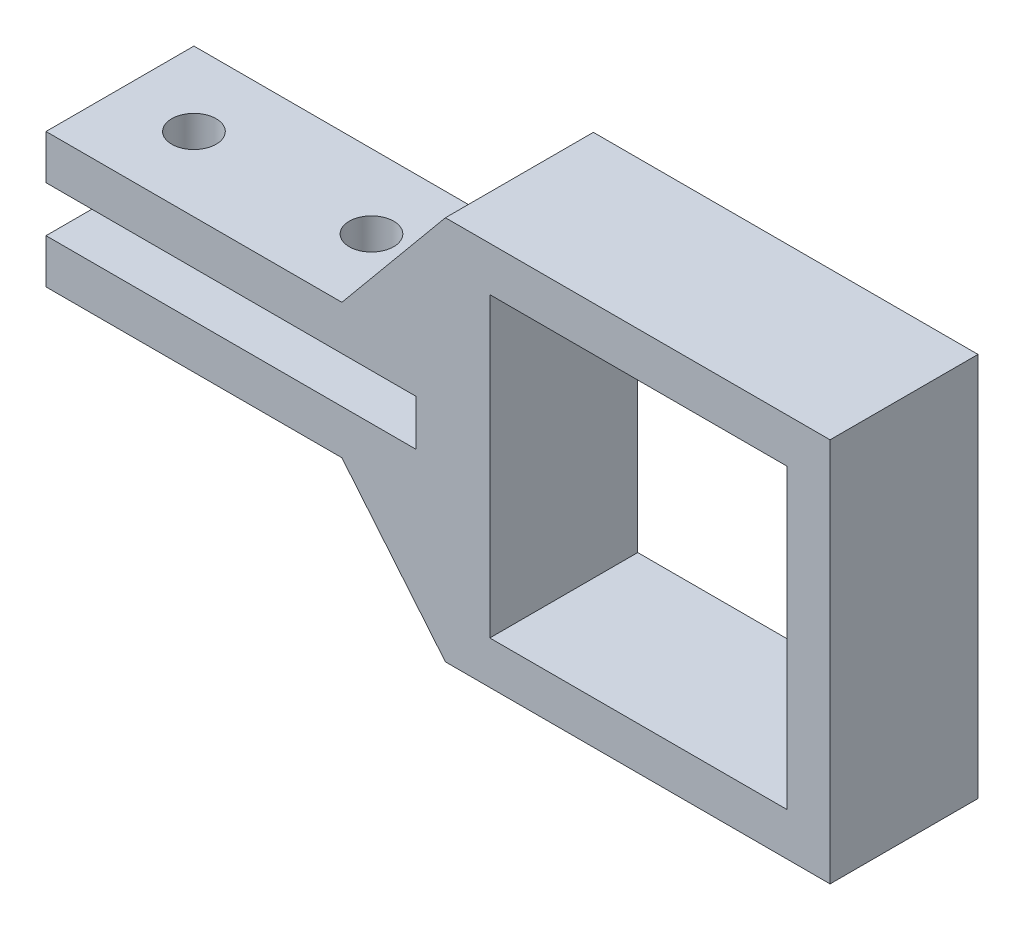
ISO-10303-21;
HEADER;
FILE_DESCRIPTION(('STEP AP214'),'2;1');
FILE_NAME('part.step','',(''),(''),'','','');
FILE_SCHEMA(('AUTOMOTIVE_DESIGN { 1 0 10303 214 1 1 1 1 }'));
ENDSEC;
DATA;
#1=APPLICATION_CONTEXT('core data for automotive mechanical design processes');
#2=APPLICATION_PROTOCOL_DEFINITION('international standard','automotive_design',2000,#1);
#3=PRODUCT_CONTEXT('',#1,'mechanical');
#4=PRODUCT('Part','Part','',(#3));
#5=PRODUCT_RELATED_PRODUCT_CATEGORY('part','',(#4));
#6=PRODUCT_DEFINITION_FORMATION('','',#4);
#7=PRODUCT_DEFINITION_CONTEXT('part definition',#1,'design');
#8=PRODUCT_DEFINITION('design','',#6,#7);
#9=PRODUCT_DEFINITION_SHAPE('','',#8);
#10=(LENGTH_UNIT() NAMED_UNIT(*) SI_UNIT(.MILLI.,.METRE.));
#11=(NAMED_UNIT(*) PLANE_ANGLE_UNIT() SI_UNIT($,.RADIAN.));
#12=(NAMED_UNIT(*) SI_UNIT($,.STERADIAN.) SOLID_ANGLE_UNIT());
#13=UNCERTAINTY_MEASURE_WITH_UNIT(LENGTH_MEASURE(1.E-05),#10,'distance_accuracy_value','');
#14=(GEOMETRIC_REPRESENTATION_CONTEXT(3) GLOBAL_UNCERTAINTY_ASSIGNED_CONTEXT((#13)) GLOBAL_UNIT_ASSIGNED_CONTEXT((#10,
#11,#12)) REPRESENTATION_CONTEXT('',''));
#15=CARTESIAN_POINT('',(0.,0.,0.));
#16=DIRECTION('',(0.,0.,1.));
#17=DIRECTION('',(1.,0.,0.));
#18=AXIS2_PLACEMENT_3D('',#15,#16,#17);
#19=CARTESIAN_POINT('',(0.,-13.,10.));
#20=DIRECTION('',(-0.770085518726512,-0.637940666400661,0.));
#21=DIRECTION('',(0.637940666400661,-0.770085518726512,0.));
#22=AXIS2_PLACEMENT_3D('',#19,#20,#21);
#23=PLANE('',#22);
#24=DIRECTION('',(-0.637940666400661,0.770085518726512,0.));
#25=VECTOR('',#24,1.);
#26=CARTESIAN_POINT('',(0.,-13.,0.));
#27=LINE('',#26,#25);
#28=CARTESIAN_POINT('',(0.,-13.,0.));
#29=VERTEX_POINT('',#28);
#30=CARTESIAN_POINT('',(-7.,-4.55,0.));
#31=VERTEX_POINT('',#30);
#32=EDGE_CURVE('E171',#29,#31,#27,.T.);
#33=ORIENTED_EDGE('',*,*,#32,.F.);
#34=DIRECTION('',(0.,0.,-1.));
#35=VECTOR('',#34,1.);
#36=CARTESIAN_POINT('',(0.,-13.,10.));
#37=LINE('',#36,#35);
#38=CARTESIAN_POINT('',(0.,-13.,10.));
#39=VERTEX_POINT('',#38);
#40=EDGE_CURVE('E238',#39,#29,#37,.T.);
#41=ORIENTED_EDGE('',*,*,#40,.F.);
#42=DIRECTION('',(-0.637940666400661,0.770085518726512,0.));
#43=VECTOR('',#42,1.);
#44=CARTESIAN_POINT('',(0.,-13.,10.));
#45=LINE('',#44,#43);
#46=CARTESIAN_POINT('',(-7.,-4.55,10.));
#47=VERTEX_POINT('',#46);
#48=EDGE_CURVE('E174',#39,#47,#45,.T.);
#49=ORIENTED_EDGE('',*,*,#48,.T.);
#50=DIRECTION('',(0.,0.,-1.));
#51=VECTOR('',#50,1.);
#52=CARTESIAN_POINT('',(-7.,-4.55,10.));
#53=LINE('',#52,#51);
#54=EDGE_CURVE('E205',#47,#31,#53,.T.);
#55=ORIENTED_EDGE('',*,*,#54,.T.);
#56=EDGE_LOOP('',(#33,#41,#49,#55));
#57=FACE_BOUND('',#56,.T.);
#58=ADVANCED_FACE('F33',(#57),#23,.T.);
#59=CARTESIAN_POINT('',(0.,-13.,10.));
#60=DIRECTION('',(0.,1.,0.));
#61=DIRECTION('',(-1.,0.,0.));
#62=AXIS2_PLACEMENT_3D('',#59,#60,#61);
#63=PLANE('',#62);
#64=DIRECTION('',(1.,0.,0.));
#65=VECTOR('',#64,1.);
#66=CARTESIAN_POINT('',(0.,-13.,0.));
#67=LINE('',#66,#65);
#68=CARTESIAN_POINT('',(26.,-13.,0.));
#69=VERTEX_POINT('',#68);
#70=EDGE_CURVE('E178',#29,#69,#67,.T.);
#71=ORIENTED_EDGE('',*,*,#70,.T.);
#72=DIRECTION('',(0.,0.,-1.));
#73=VECTOR('',#72,1.);
#74=CARTESIAN_POINT('',(26.,-13.,10.));
#75=LINE('',#74,#73);
#76=CARTESIAN_POINT('',(26.,-13.,10.));
#77=VERTEX_POINT('',#76);
#78=EDGE_CURVE('E241',#77,#69,#75,.T.);
#79=ORIENTED_EDGE('',*,*,#78,.F.);
#80=DIRECTION('',(1.,0.,0.));
#81=VECTOR('',#80,1.);
#82=CARTESIAN_POINT('',(0.,-13.,10.));
#83=LINE('',#82,#81);
#84=EDGE_CURVE('E203',#39,#77,#83,.T.);
#85=ORIENTED_EDGE('',*,*,#84,.F.);
#86=ORIENTED_EDGE('',*,*,#40,.T.);
#87=EDGE_LOOP('',(#71,#79,#85,#86));
#88=FACE_BOUND('',#87,.T.);
#89=ADVANCED_FACE('F284',(#88),#63,.F.);
#90=CARTESIAN_POINT('',(26.,13.,10.));
#91=DIRECTION('',(1.,0.,0.));
#92=DIRECTION('',(0.,0.,-1.));
#93=AXIS2_PLACEMENT_3D('',#90,#91,#92);
#94=PLANE('',#93);
#95=DIRECTION('',(0.,-1.,0.));
#96=VECTOR('',#95,1.);
#97=CARTESIAN_POINT('',(26.,13.,0.));
#98=LINE('',#97,#96);
#99=CARTESIAN_POINT('',(26.,13.,0.));
#100=VERTEX_POINT('',#99);
#101=EDGE_CURVE('E233',#100,#69,#98,.T.);
#102=ORIENTED_EDGE('',*,*,#101,.F.);
#103=DIRECTION('',(0.,0.,-1.));
#104=VECTOR('',#103,1.);
#105=CARTESIAN_POINT('',(26.,13.,10.));
#106=LINE('',#105,#104);
#107=CARTESIAN_POINT('',(26.,13.,10.));
#108=VERTEX_POINT('',#107);
#109=EDGE_CURVE('E243',#108,#100,#106,.T.);
#110=ORIENTED_EDGE('',*,*,#109,.F.);
#111=DIRECTION('',(0.,-1.,0.));
#112=VECTOR('',#111,1.);
#113=CARTESIAN_POINT('',(26.,13.,10.));
#114=LINE('',#113,#112);
#115=EDGE_CURVE('E200',#108,#77,#114,.T.);
#116=ORIENTED_EDGE('',*,*,#115,.T.);
#117=ORIENTED_EDGE('',*,*,#78,.T.);
#118=EDGE_LOOP('',(#102,#110,#116,#117));
#119=FACE_BOUND('',#118,.T.);
#120=ADVANCED_FACE('F289',(#119),#94,.T.);
#121=CARTESIAN_POINT('',(0.,13.,10.));
#122=DIRECTION('',(0.,1.,0.));
#123=DIRECTION('',(-1.,0.,0.));
#124=AXIS2_PLACEMENT_3D('',#121,#122,#123);
#125=PLANE('',#124);
#126=DIRECTION('',(1.,0.,0.));
#127=VECTOR('',#126,1.);
#128=CARTESIAN_POINT('',(0.,13.,0.));
#129=LINE('',#128,#127);
#130=CARTESIAN_POINT('',(0.,13.,0.));
#131=VERTEX_POINT('',#130);
#132=EDGE_CURVE('E230',#131,#100,#129,.T.);
#133=ORIENTED_EDGE('',*,*,#132,.F.);
#134=DIRECTION('',(0.,0.,-1.));
#135=VECTOR('',#134,1.);
#136=CARTESIAN_POINT('',(0.,13.,10.));
#137=LINE('',#136,#135);
#138=CARTESIAN_POINT('',(0.,13.,10.));
#139=VERTEX_POINT('',#138);
#140=EDGE_CURVE('E245',#139,#131,#137,.T.);
#141=ORIENTED_EDGE('',*,*,#140,.F.);
#142=DIRECTION('',(1.,0.,0.));
#143=VECTOR('',#142,1.);
#144=CARTESIAN_POINT('',(0.,13.,10.));
#145=LINE('',#144,#143);
#146=EDGE_CURVE('E197',#139,#108,#145,.T.);
#147=ORIENTED_EDGE('',*,*,#146,.T.);
#148=ORIENTED_EDGE('',*,*,#109,.T.);
#149=EDGE_LOOP('',(#133,#141,#147,#148));
#150=FACE_BOUND('',#149,.T.);
#151=ADVANCED_FACE('F337',(#150),#125,.T.);
#152=CARTESIAN_POINT('',(0.,13.,10.));
#153=DIRECTION('',(0.770085518726512,-0.637940666400661,0.));
#154=DIRECTION('',(0.637940666400661,0.770085518726512,0.));
#155=AXIS2_PLACEMENT_3D('',#152,#153,#154);
#156=PLANE('',#155);
#157=DIRECTION('',(-0.637940666400661,-0.770085518726512,0.));
#158=VECTOR('',#157,1.);
#159=CARTESIAN_POINT('',(0.,13.,0.));
#160=LINE('',#159,#158);
#161=CARTESIAN_POINT('',(-7.,4.55,0.));
#162=VERTEX_POINT('',#161);
#163=EDGE_CURVE('E227',#131,#162,#160,.T.);
#164=ORIENTED_EDGE('',*,*,#163,.T.);
#165=DIRECTION('',(0.,0.,-1.));
#166=VECTOR('',#165,1.);
#167=CARTESIAN_POINT('',(-7.,4.55,10.));
#168=LINE('',#167,#166);
#169=CARTESIAN_POINT('',(-7.,4.55,10.));
#170=VERTEX_POINT('',#169);
#171=EDGE_CURVE('E247',#170,#162,#168,.T.);
#172=ORIENTED_EDGE('',*,*,#171,.F.);
#173=DIRECTION('',(-0.637940666400661,-0.770085518726512,0.));
#174=VECTOR('',#173,1.);
#175=CARTESIAN_POINT('',(0.,13.,10.));
#176=LINE('',#175,#174);
#177=EDGE_CURVE('E195',#139,#170,#176,.T.);
#178=ORIENTED_EDGE('',*,*,#177,.F.);
#179=ORIENTED_EDGE('',*,*,#140,.T.);
#180=EDGE_LOOP('',(#164,#172,#178,#179));
#181=FACE_BOUND('',#180,.T.);
#182=ADVANCED_FACE('F334',(#181),#156,.F.);
#183=CARTESIAN_POINT('',(-27.,4.55,10.));
#184=DIRECTION('',(0.,1.,0.));
#185=DIRECTION('',(0.,0.,1.));
#186=AXIS2_PLACEMENT_3D('',#183,#184,#185);
#187=PLANE('',#186);
#188=CARTESIAN_POINT('',(-22.,4.55,5.));
#189=DIRECTION('',(0.,1.,0.));
#190=DIRECTION('',(-1.,0.,0.));
#191=AXIS2_PLACEMENT_3D('',#188,#189,#190);
#192=CIRCLE('',#191,1.5);
#193=CARTESIAN_POINT('',(-23.5,4.55,5.));
#194=VERTEX_POINT('',#193);
#195=EDGE_CURVE('E372',#194,#194,#192,.T.);
#196=ORIENTED_EDGE('',*,*,#195,.F.);
#197=EDGE_LOOP('',(#196));
#198=FACE_BOUND('',#197,.T.);
#199=CARTESIAN_POINT('',(-10.,4.55,5.));
#200=DIRECTION('',(0.,1.,0.));
#201=DIRECTION('',(-1.,0.,0.));
#202=AXIS2_PLACEMENT_3D('',#199,#200,#201);
#203=CIRCLE('',#202,1.5);
#204=CARTESIAN_POINT('',(-11.5,4.55,5.));
#205=VERTEX_POINT('',#204);
#206=EDGE_CURVE('E373',#205,#205,#203,.T.);
#207=ORIENTED_EDGE('',*,*,#206,.F.);
#208=EDGE_LOOP('',(#207));
#209=FACE_BOUND('',#208,.T.);
#210=DIRECTION('',(1.,0.,0.));
#211=VECTOR('',#210,1.);
#212=CARTESIAN_POINT('',(-27.,4.55,0.));
#213=LINE('',#212,#211);
#214=CARTESIAN_POINT('',(-27.,4.55,0.));
#215=VERTEX_POINT('',#214);
#216=EDGE_CURVE('E224',#215,#162,#213,.T.);
#217=ORIENTED_EDGE('',*,*,#216,.F.);
#218=DIRECTION('',(0.,0.,-1.));
#219=VECTOR('',#218,1.);
#220=CARTESIAN_POINT('',(-27.,4.55,10.));
#221=LINE('',#220,#219);
#222=CARTESIAN_POINT('',(-27.,4.55,10.));
#223=VERTEX_POINT('',#222);
#224=EDGE_CURVE('E249',#223,#215,#221,.T.);
#225=ORIENTED_EDGE('',*,*,#224,.F.);
#226=DIRECTION('',(1.,0.,0.));
#227=VECTOR('',#226,1.);
#228=CARTESIAN_POINT('',(-27.,4.55,10.));
#229=LINE('',#228,#227);
#230=EDGE_CURVE('E192',#223,#170,#229,.T.);
#231=ORIENTED_EDGE('',*,*,#230,.T.);
#232=ORIENTED_EDGE('',*,*,#171,.T.);
#233=EDGE_LOOP('',(#217,#225,#231,#232));
#234=FACE_BOUND('',#233,.T.);
#235=ADVANCED_FACE('F328',(#198,#209,#234),#187,.T.);
#236=CARTESIAN_POINT('',(-27.,4.55,10.));
#237=DIRECTION('',(1.,0.,0.));
#238=DIRECTION('',(0.,0.,-1.));
#239=AXIS2_PLACEMENT_3D('',#236,#237,#238);
#240=PLANE('',#239);
#241=DIRECTION('',(0.,-1.,0.));
#242=VECTOR('',#241,1.);
#243=CARTESIAN_POINT('',(-27.,4.55,0.));
#244=LINE('',#243,#242);
#245=CARTESIAN_POINT('',(-27.,1.55,0.));
#246=VERTEX_POINT('',#245);
#247=EDGE_CURVE('E222',#215,#246,#244,.T.);
#248=ORIENTED_EDGE('',*,*,#247,.T.);
#249=DIRECTION('',(0.,0.,-1.));
#250=VECTOR('',#249,1.);
#251=CARTESIAN_POINT('',(-27.,1.55,10.));
#252=LINE('',#251,#250);
#253=CARTESIAN_POINT('',(-27.,1.55,10.));
#254=VERTEX_POINT('',#253);
#255=EDGE_CURVE('E251',#254,#246,#252,.T.);
#256=ORIENTED_EDGE('',*,*,#255,.F.);
#257=DIRECTION('',(0.,-1.,0.));
#258=VECTOR('',#257,1.);
#259=CARTESIAN_POINT('',(-27.,4.55,10.));
#260=LINE('',#259,#258);
#261=EDGE_CURVE('E190',#223,#254,#260,.T.);
#262=ORIENTED_EDGE('',*,*,#261,.F.);
#263=ORIENTED_EDGE('',*,*,#224,.T.);
#264=EDGE_LOOP('',(#248,#256,#262,#263));
#265=FACE_BOUND('',#264,.T.);
#266=ADVANCED_FACE('F340',(#265),#240,.F.);
#267=CARTESIAN_POINT('',(-27.,1.55,10.));
#268=DIRECTION('',(0.,1.,0.));
#269=DIRECTION('',(0.,0.,1.));
#270=AXIS2_PLACEMENT_3D('',#267,#268,#269);
#271=PLANE('',#270);
#272=CARTESIAN_POINT('',(-22.,1.55,5.));
#273=DIRECTION('',(0.,1.,0.));
#274=DIRECTION('',(0.,0.,1.));
#275=AXIS2_PLACEMENT_3D('',#272,#273,#274);
#276=CIRCLE('',#275,1.5);
#277=CARTESIAN_POINT('',(-22.,1.55,6.5));
#278=VERTEX_POINT('',#277);
#279=EDGE_CURVE('E390',#278,#278,#276,.T.);
#280=ORIENTED_EDGE('',*,*,#279,.T.);
#281=EDGE_LOOP('',(#280));
#282=FACE_BOUND('',#281,.T.);
#283=CARTESIAN_POINT('',(-10.,1.55,5.));
#284=DIRECTION('',(0.,1.,0.));
#285=DIRECTION('',(0.,0.,1.));
#286=AXIS2_PLACEMENT_3D('',#283,#284,#285);
#287=CIRCLE('',#286,1.5);
#288=CARTESIAN_POINT('',(-10.,1.55,6.5));
#289=VERTEX_POINT('',#288);
#290=EDGE_CURVE('E384',#289,#289,#287,.T.);
#291=ORIENTED_EDGE('',*,*,#290,.T.);
#292=EDGE_LOOP('',(#291));
#293=FACE_BOUND('',#292,.T.);
#294=DIRECTION('',(1.,0.,0.));
#295=VECTOR('',#294,1.);
#296=CARTESIAN_POINT('',(-27.,1.55,0.));
#297=LINE('',#296,#295);
#298=CARTESIAN_POINT('',(-2.,1.55,0.));
#299=VERTEX_POINT('',#298);
#300=EDGE_CURVE('E220',#246,#299,#297,.T.);
#301=ORIENTED_EDGE('',*,*,#300,.T.);
#302=DIRECTION('',(0.,0.,-1.));
#303=VECTOR('',#302,1.);
#304=CARTESIAN_POINT('',(-2.,1.55,10.));
#305=LINE('',#304,#303);
#306=CARTESIAN_POINT('',(-2.,1.55,10.));
#307=VERTEX_POINT('',#306);
#308=EDGE_CURVE('E254',#307,#299,#305,.T.);
#309=ORIENTED_EDGE('',*,*,#308,.F.);
#310=DIRECTION('',(1.,0.,0.));
#311=VECTOR('',#310,1.);
#312=CARTESIAN_POINT('',(-27.,1.55,10.));
#313=LINE('',#312,#311);
#314=EDGE_CURVE('E188',#254,#307,#313,.T.);
#315=ORIENTED_EDGE('',*,*,#314,.F.);
#316=ORIENTED_EDGE('',*,*,#255,.T.);
#317=EDGE_LOOP('',(#301,#309,#315,#316));
#318=FACE_BOUND('',#317,.T.);
#319=ADVANCED_FACE('F321',(#282,#293,#318),#271,.F.);
#320=CARTESIAN_POINT('',(-2.,1.55,10.));
#321=DIRECTION('',(1.,0.,0.));
#322=DIRECTION('',(0.,0.,-1.));
#323=AXIS2_PLACEMENT_3D('',#320,#321,#322);
#324=PLANE('',#323);
#325=DIRECTION('',(0.,-1.,0.));
#326=VECTOR('',#325,1.);
#327=CARTESIAN_POINT('',(-2.,1.55,0.));
#328=LINE('',#327,#326);
#329=CARTESIAN_POINT('',(-2.,-1.55,0.));
#330=VERTEX_POINT('',#329);
#331=EDGE_CURVE('E217',#299,#330,#328,.T.);
#332=ORIENTED_EDGE('',*,*,#331,.T.);
#333=DIRECTION('',(0.,0.,-1.));
#334=VECTOR('',#333,1.);
#335=CARTESIAN_POINT('',(-2.,-1.55,10.));
#336=LINE('',#335,#334);
#337=CARTESIAN_POINT('',(-2.,-1.55,10.));
#338=VERTEX_POINT('',#337);
#339=EDGE_CURVE('E257',#338,#330,#336,.T.);
#340=ORIENTED_EDGE('',*,*,#339,.F.);
#341=DIRECTION('',(0.,-1.,0.));
#342=VECTOR('',#341,1.);
#343=CARTESIAN_POINT('',(-2.,1.55,10.));
#344=LINE('',#343,#342);
#345=EDGE_CURVE('E186',#307,#338,#344,.T.);
#346=ORIENTED_EDGE('',*,*,#345,.F.);
#347=ORIENTED_EDGE('',*,*,#308,.T.);
#348=EDGE_LOOP('',(#332,#340,#346,#347));
#349=FACE_BOUND('',#348,.T.);
#350=ADVANCED_FACE('F317',(#349),#324,.F.);
#351=CARTESIAN_POINT('',(-27.,-1.55,10.));
#352=DIRECTION('',(0.,1.,0.));
#353=DIRECTION('',(0.,0.,1.));
#354=AXIS2_PLACEMENT_3D('',#351,#352,#353);
#355=PLANE('',#354);
#356=CARTESIAN_POINT('',(-22.,-1.55,5.));
#357=DIRECTION('',(0.,1.,0.));
#358=DIRECTION('',(0.,0.,1.));
#359=AXIS2_PLACEMENT_3D('',#356,#357,#358);
#360=CIRCLE('',#359,1.5);
#361=CARTESIAN_POINT('',(-22.,-1.55,6.5));
#362=VERTEX_POINT('',#361);
#363=EDGE_CURVE('E387',#362,#362,#360,.T.);
#364=ORIENTED_EDGE('',*,*,#363,.F.);
#365=EDGE_LOOP('',(#364));
#366=FACE_BOUND('',#365,.T.);
#367=CARTESIAN_POINT('',(-10.,-1.55,5.));
#368=DIRECTION('',(0.,1.,0.));
#369=DIRECTION('',(0.,0.,1.));
#370=AXIS2_PLACEMENT_3D('',#367,#368,#369);
#371=CIRCLE('',#370,1.5);
#372=CARTESIAN_POINT('',(-10.,-1.55,6.5));
#373=VERTEX_POINT('',#372);
#374=EDGE_CURVE('E381',#373,#373,#371,.T.);
#375=ORIENTED_EDGE('',*,*,#374,.F.);
#376=EDGE_LOOP('',(#375));
#377=FACE_BOUND('',#376,.T.);
#378=DIRECTION('',(1.,0.,0.));
#379=VECTOR('',#378,1.);
#380=CARTESIAN_POINT('',(-27.,-1.55,0.));
#381=LINE('',#380,#379);
#382=CARTESIAN_POINT('',(-27.,-1.55,0.));
#383=VERTEX_POINT('',#382);
#384=EDGE_CURVE('E214',#383,#330,#381,.T.);
#385=ORIENTED_EDGE('',*,*,#384,.F.);
#386=DIRECTION('',(0.,0.,-1.));
#387=VECTOR('',#386,1.);
#388=CARTESIAN_POINT('',(-27.,-1.55,10.));
#389=LINE('',#388,#387);
#390=CARTESIAN_POINT('',(-27.,-1.55,10.));
#391=VERTEX_POINT('',#390);
#392=EDGE_CURVE('E259',#391,#383,#389,.T.);
#393=ORIENTED_EDGE('',*,*,#392,.F.);
#394=DIRECTION('',(1.,0.,0.));
#395=VECTOR('',#394,1.);
#396=CARTESIAN_POINT('',(-27.,-1.55,10.));
#397=LINE('',#396,#395);
#398=EDGE_CURVE('E183',#391,#338,#397,.T.);
#399=ORIENTED_EDGE('',*,*,#398,.T.);
#400=ORIENTED_EDGE('',*,*,#339,.T.);
#401=EDGE_LOOP('',(#385,#393,#399,#400));
#402=FACE_BOUND('',#401,.T.);
#403=ADVANCED_FACE('F313',(#366,#377,#402),#355,.T.);
#404=CARTESIAN_POINT('',(-27.,-4.55,10.));
#405=DIRECTION('',(-1.,0.,0.));
#406=DIRECTION('',(0.,0.,1.));
#407=AXIS2_PLACEMENT_3D('',#404,#405,#406);
#408=PLANE('',#407);
#409=DIRECTION('',(0.,1.,0.));
#410=VECTOR('',#409,1.);
#411=CARTESIAN_POINT('',(-27.,-4.55,0.));
#412=LINE('',#411,#410);
#413=CARTESIAN_POINT('',(-27.,-4.55,0.));
#414=VERTEX_POINT('',#413);
#415=EDGE_CURVE('E211',#414,#383,#412,.T.);
#416=ORIENTED_EDGE('',*,*,#415,.F.);
#417=DIRECTION('',(0.,0.,-1.));
#418=VECTOR('',#417,1.);
#419=CARTESIAN_POINT('',(-27.,-4.55,10.));
#420=LINE('',#419,#418);
#421=CARTESIAN_POINT('',(-27.,-4.55,10.));
#422=VERTEX_POINT('',#421);
#423=EDGE_CURVE('E261',#422,#414,#420,.T.);
#424=ORIENTED_EDGE('',*,*,#423,.F.);
#425=DIRECTION('',(0.,1.,0.));
#426=VECTOR('',#425,1.);
#427=CARTESIAN_POINT('',(-27.,-4.55,10.));
#428=LINE('',#427,#426);
#429=EDGE_CURVE('E180',#422,#391,#428,.T.);
#430=ORIENTED_EDGE('',*,*,#429,.T.);
#431=ORIENTED_EDGE('',*,*,#392,.T.);
#432=EDGE_LOOP('',(#416,#424,#430,#431));
#433=FACE_BOUND('',#432,.T.);
#434=ADVANCED_FACE('F308',(#433),#408,.T.);
#435=CARTESIAN_POINT('',(-27.,-4.55,10.));
#436=DIRECTION('',(0.,1.,0.));
#437=DIRECTION('',(0.,0.,1.));
#438=AXIS2_PLACEMENT_3D('',#435,#436,#437);
#439=PLANE('',#438);
#440=CARTESIAN_POINT('',(-22.,-4.55,5.));
#441=DIRECTION('',(0.,1.,0.));
#442=DIRECTION('',(0.,0.,1.));
#443=AXIS2_PLACEMENT_3D('',#440,#441,#442);
#444=CIRCLE('',#443,1.5);
#445=CARTESIAN_POINT('',(-22.,-4.55,6.5));
#446=VERTEX_POINT('',#445);
#447=EDGE_CURVE('E367',#446,#446,#444,.F.);
#448=ORIENTED_EDGE('',*,*,#447,.F.);
#449=EDGE_LOOP('',(#448));
#450=FACE_BOUND('',#449,.T.);
#451=CARTESIAN_POINT('',(-10.,-4.55,5.));
#452=DIRECTION('',(0.,1.,0.));
#453=DIRECTION('',(0.,0.,1.));
#454=AXIS2_PLACEMENT_3D('',#451,#452,#453);
#455=CIRCLE('',#454,1.5);
#456=CARTESIAN_POINT('',(-10.,-4.55,6.5));
#457=VERTEX_POINT('',#456);
#458=EDGE_CURVE('E370',#457,#457,#455,.F.);
#459=ORIENTED_EDGE('',*,*,#458,.F.);
#460=EDGE_LOOP('',(#459));
#461=FACE_BOUND('',#460,.T.);
#462=DIRECTION('',(1.,0.,0.));
#463=VECTOR('',#462,1.);
#464=CARTESIAN_POINT('',(-27.,-4.55,0.));
#465=LINE('',#464,#463);
#466=EDGE_CURVE('E208',#414,#31,#465,.T.);
#467=ORIENTED_EDGE('',*,*,#466,.T.);
#468=ORIENTED_EDGE('',*,*,#54,.F.);
#469=DIRECTION('',(1.,0.,0.));
#470=VECTOR('',#469,1.);
#471=CARTESIAN_POINT('',(-27.,-4.55,10.));
#472=LINE('',#471,#470);
#473=EDGE_CURVE('E177',#422,#47,#472,.T.);
#474=ORIENTED_EDGE('',*,*,#473,.F.);
#475=ORIENTED_EDGE('',*,*,#423,.T.);
#476=EDGE_LOOP('',(#467,#468,#474,#475));
#477=FACE_BOUND('',#476,.T.);
#478=ADVANCED_FACE('F306',(#450,#461,#477),#439,.F.);
#479=CARTESIAN_POINT('',(0.,0.,10.));
#480=DIRECTION('',(0.,0.,1.));
#481=DIRECTION('',(1.,0.,0.));
#482=AXIS2_PLACEMENT_3D('',#479,#480,#481);
#483=PLANE('',#482);
#484=DIRECTION('',(-1.,0.,0.));
#485=VECTOR('',#484,1.);
#486=CARTESIAN_POINT('',(23.1,10.,10.));
#487=LINE('',#486,#485);
#488=CARTESIAN_POINT('',(23.1,10.,10.));
#489=VERTEX_POINT('',#488);
#490=CARTESIAN_POINT('',(3.,10.,10.));
#491=VERTEX_POINT('',#490);
#492=EDGE_CURVE('E47',#489,#491,#487,.T.);
#493=ORIENTED_EDGE('',*,*,#492,.F.);
#494=DIRECTION('',(0.,1.,0.));
#495=VECTOR('',#494,1.);
#496=CARTESIAN_POINT('',(23.1,10.,10.));
#497=LINE('',#496,#495);
#498=CARTESIAN_POINT('',(23.1,-10.1,10.));
#499=VERTEX_POINT('',#498);
#500=EDGE_CURVE('E164',#499,#489,#497,.T.);
#501=ORIENTED_EDGE('',*,*,#500,.F.);
#502=DIRECTION('',(1.,0.,0.));
#503=VECTOR('',#502,1.);
#504=CARTESIAN_POINT('',(3.,-10.1,10.));
#505=LINE('',#504,#503);
#506=CARTESIAN_POINT('',(3.,-10.1,10.));
#507=VERTEX_POINT('',#506);
#508=EDGE_CURVE('E148',#507,#499,#505,.T.);
#509=ORIENTED_EDGE('',*,*,#508,.F.);
#510=DIRECTION('',(0.,-1.,0.));
#511=VECTOR('',#510,1.);
#512=CARTESIAN_POINT('',(3.,10.,10.));
#513=LINE('',#512,#511);
#514=EDGE_CURVE('E157',#491,#507,#513,.T.);
#515=ORIENTED_EDGE('',*,*,#514,.F.);
#516=EDGE_LOOP('',(#493,#501,#509,#515));
#517=FACE_BOUND('',#516,.T.);
#518=ORIENTED_EDGE('',*,*,#48,.F.);
#519=ORIENTED_EDGE('',*,*,#84,.T.);
#520=ORIENTED_EDGE('',*,*,#115,.F.);
#521=ORIENTED_EDGE('',*,*,#146,.F.);
#522=ORIENTED_EDGE('',*,*,#177,.T.);
#523=ORIENTED_EDGE('',*,*,#230,.F.);
#524=ORIENTED_EDGE('',*,*,#261,.T.);
#525=ORIENTED_EDGE('',*,*,#314,.T.);
#526=ORIENTED_EDGE('',*,*,#345,.T.);
#527=ORIENTED_EDGE('',*,*,#398,.F.);
#528=ORIENTED_EDGE('',*,*,#429,.F.);
#529=ORIENTED_EDGE('',*,*,#473,.T.);
#530=EDGE_LOOP('',(#518,#519,#520,#521,#522,#523,#524,#525,#526,#527,#528,#529));
#531=FACE_BOUND('',#530,.T.);
#532=ADVANCED_FACE('F161',(#517,#531),#483,.T.);
#533=CARTESIAN_POINT('',(0.,0.,0.));
#534=DIRECTION('',(0.,0.,1.));
#535=DIRECTION('',(1.,0.,0.));
#536=AXIS2_PLACEMENT_3D('',#533,#534,#535);
#537=PLANE('',#536);
#538=DIRECTION('',(0.,1.,0.));
#539=VECTOR('',#538,1.);
#540=CARTESIAN_POINT('',(23.1,0.,0.));
#541=LINE('',#540,#539);
#542=CARTESIAN_POINT('',(23.1,-10.1,0.));
#543=VERTEX_POINT('',#542);
#544=CARTESIAN_POINT('',(23.1,10.,0.));
#545=VERTEX_POINT('',#544);
#546=EDGE_CURVE('E40',#543,#545,#541,.T.);
#547=ORIENTED_EDGE('',*,*,#546,.T.);
#548=DIRECTION('',(-1.,0.,0.));
#549=VECTOR('',#548,1.);
#550=CARTESIAN_POINT('',(0.,10.,0.));
#551=LINE('',#550,#549);
#552=CARTESIAN_POINT('',(3.,10.,0.));
#553=VERTEX_POINT('',#552);
#554=EDGE_CURVE('E11',#545,#553,#551,.T.);
#555=ORIENTED_EDGE('',*,*,#554,.T.);
#556=DIRECTION('',(0.,-1.,0.));
#557=VECTOR('',#556,1.);
#558=CARTESIAN_POINT('',(3.,0.,0.));
#559=LINE('',#558,#557);
#560=CARTESIAN_POINT('',(3.,-10.1,0.));
#561=VERTEX_POINT('',#560);
#562=EDGE_CURVE('E240',#553,#561,#559,.T.);
#563=ORIENTED_EDGE('',*,*,#562,.T.);
#564=DIRECTION('',(1.,0.,0.));
#565=VECTOR('',#564,1.);
#566=CARTESIAN_POINT('',(0.,-10.1,0.));
#567=LINE('',#566,#565);
#568=EDGE_CURVE('E151',#561,#543,#567,.T.);
#569=ORIENTED_EDGE('',*,*,#568,.T.);
#570=EDGE_LOOP('',(#547,#555,#563,#569));
#571=FACE_BOUND('',#570,.T.);
#572=ORIENTED_EDGE('',*,*,#32,.T.);
#573=ORIENTED_EDGE('',*,*,#466,.F.);
#574=ORIENTED_EDGE('',*,*,#415,.T.);
#575=ORIENTED_EDGE('',*,*,#384,.T.);
#576=ORIENTED_EDGE('',*,*,#331,.F.);
#577=ORIENTED_EDGE('',*,*,#300,.F.);
#578=ORIENTED_EDGE('',*,*,#247,.F.);
#579=ORIENTED_EDGE('',*,*,#216,.T.);
#580=ORIENTED_EDGE('',*,*,#163,.F.);
#581=ORIENTED_EDGE('',*,*,#132,.T.);
#582=ORIENTED_EDGE('',*,*,#101,.T.);
#583=ORIENTED_EDGE('',*,*,#70,.F.);
#584=EDGE_LOOP('',(#572,#573,#574,#575,#576,#577,#578,#579,#580,#581,#582,#583));
#585=FACE_BOUND('',#584,.T.);
#586=ADVANCED_FACE('F267',(#571,#585),#537,.F.);
#587=CARTESIAN_POINT('',(23.1,10.,-20.));
#588=DIRECTION('',(0.,1.,0.));
#589=DIRECTION('',(0.,0.,1.));
#590=AXIS2_PLACEMENT_3D('',#587,#588,#589);
#591=PLANE('',#590);
#592=DIRECTION('',(0.,0.,1.));
#593=VECTOR('',#592,1.);
#594=CARTESIAN_POINT('',(23.1,10.,-20.));
#595=LINE('',#594,#593);
#596=EDGE_CURVE('E169',#545,#489,#595,.T.);
#597=ORIENTED_EDGE('',*,*,#596,.T.);
#598=ORIENTED_EDGE('',*,*,#492,.T.);
#599=DIRECTION('',(0.,0.,1.));
#600=VECTOR('',#599,1.);
#601=CARTESIAN_POINT('',(3.,10.,-20.));
#602=LINE('',#601,#600);
#603=EDGE_CURVE('E154',#553,#491,#602,.T.);
#604=ORIENTED_EDGE('',*,*,#603,.F.);
#605=ORIENTED_EDGE('',*,*,#554,.F.);
#606=EDGE_LOOP('',(#597,#598,#604,#605));
#607=FACE_BOUND('',#606,.T.);
#608=ADVANCED_FACE('F272',(#607),#591,.F.);
#609=CARTESIAN_POINT('',(23.1,10.,-20.));
#610=DIRECTION('',(1.,0.,0.));
#611=DIRECTION('',(0.,0.,-1.));
#612=AXIS2_PLACEMENT_3D('',#609,#610,#611);
#613=PLANE('',#612);
#614=DIRECTION('',(0.,0.,1.));
#615=VECTOR('',#614,1.);
#616=CARTESIAN_POINT('',(23.1,-10.1,-20.));
#617=LINE('',#616,#615);
#618=EDGE_CURVE('E153',#543,#499,#617,.T.);
#619=ORIENTED_EDGE('',*,*,#618,.T.);
#620=ORIENTED_EDGE('',*,*,#500,.T.);
#621=ORIENTED_EDGE('',*,*,#596,.F.);
#622=ORIENTED_EDGE('',*,*,#546,.F.);
#623=EDGE_LOOP('',(#619,#620,#621,#622));
#624=FACE_BOUND('',#623,.T.);
#625=ADVANCED_FACE('F271',(#624),#613,.F.);
#626=CARTESIAN_POINT('',(3.,-10.1,-20.));
#627=DIRECTION('',(0.,-1.,0.));
#628=DIRECTION('',(1.,0.,0.));
#629=AXIS2_PLACEMENT_3D('',#626,#627,#628);
#630=PLANE('',#629);
#631=DIRECTION('',(0.,0.,1.));
#632=VECTOR('',#631,1.);
#633=CARTESIAN_POINT('',(3.,-10.1,-20.));
#634=LINE('',#633,#632);
#635=EDGE_CURVE('E55',#561,#507,#634,.T.);
#636=ORIENTED_EDGE('',*,*,#635,.T.);
#637=ORIENTED_EDGE('',*,*,#508,.T.);
#638=ORIENTED_EDGE('',*,*,#618,.F.);
#639=ORIENTED_EDGE('',*,*,#568,.F.);
#640=EDGE_LOOP('',(#636,#637,#638,#639));
#641=FACE_BOUND('',#640,.T.);
#642=ADVANCED_FACE('F145',(#641),#630,.F.);
#643=CARTESIAN_POINT('',(3.,10.,-20.));
#644=DIRECTION('',(-1.,0.,0.));
#645=DIRECTION('',(0.,-1.,0.));
#646=AXIS2_PLACEMENT_3D('',#643,#644,#645);
#647=PLANE('',#646);
#648=ORIENTED_EDGE('',*,*,#603,.T.);
#649=ORIENTED_EDGE('',*,*,#514,.T.);
#650=ORIENTED_EDGE('',*,*,#635,.F.);
#651=ORIENTED_EDGE('',*,*,#562,.F.);
#652=EDGE_LOOP('',(#648,#649,#650,#651));
#653=FACE_BOUND('',#652,.T.);
#654=ADVANCED_FACE('F158',(#653),#647,.F.);
#655=CARTESIAN_POINT('',(-10.,-8.7926406871193,5.));
#656=DIRECTION('',(0.,1.,0.));
#657=DIRECTION('',(-1.,0.,0.));
#658=AXIS2_PLACEMENT_3D('',#655,#656,#657);
#659=CYLINDRICAL_SURFACE('',#658,1.5);
#660=ORIENTED_EDGE('',*,*,#374,.T.);
#661=EDGE_LOOP('',(#660));
#662=FACE_BOUND('',#661,.T.);
#663=ORIENTED_EDGE('',*,*,#458,.T.);
#664=EDGE_LOOP('',(#663));
#665=FACE_BOUND('',#664,.T.);
#666=ADVANCED_FACE('F406',(#662,#665),#659,.F.);
#667=CARTESIAN_POINT('',(-22.,-8.7926406871193,5.));
#668=DIRECTION('',(0.,1.,0.));
#669=DIRECTION('',(-1.,0.,0.));
#670=AXIS2_PLACEMENT_3D('',#667,#668,#669);
#671=CYLINDRICAL_SURFACE('',#670,1.5);
#672=ORIENTED_EDGE('',*,*,#363,.T.);
#673=EDGE_LOOP('',(#672));
#674=FACE_BOUND('',#673,.T.);
#675=ORIENTED_EDGE('',*,*,#447,.T.);
#676=EDGE_LOOP('',(#675));
#677=FACE_BOUND('',#676,.T.);
#678=ADVANCED_FACE('F400',(#674,#677),#671,.F.);
#679=ORIENTED_EDGE('',*,*,#206,.T.);
#680=EDGE_LOOP('',(#679));
#681=FACE_BOUND('',#680,.T.);
#682=ORIENTED_EDGE('',*,*,#290,.F.);
#683=EDGE_LOOP('',(#682));
#684=FACE_BOUND('',#683,.T.);
#685=ADVANCED_FACE('F397',(#681,#684),#659,.F.);
#686=ORIENTED_EDGE('',*,*,#195,.T.);
#687=EDGE_LOOP('',(#686));
#688=FACE_BOUND('',#687,.T.);
#689=ORIENTED_EDGE('',*,*,#279,.F.);
#690=EDGE_LOOP('',(#689));
#691=FACE_BOUND('',#690,.T.);
#692=ADVANCED_FACE('F395',(#688,#691),#671,.F.);
#693=CLOSED_SHELL('',(#58,#89,#120,#151,#182,#235,#266,#319,#350,#403,#434,#478,#532,#586,#608,
#625,#642,#654,#666,#678,#685,#692));
#694=MANIFOLD_SOLID_BREP('B2',#693);
#695=ADVANCED_BREP_SHAPE_REPRESENTATION('',(#18,#694),#14);
#696=SHAPE_DEFINITION_REPRESENTATION(#9,#695);
ENDSEC;
END-ISO-10303-21;
